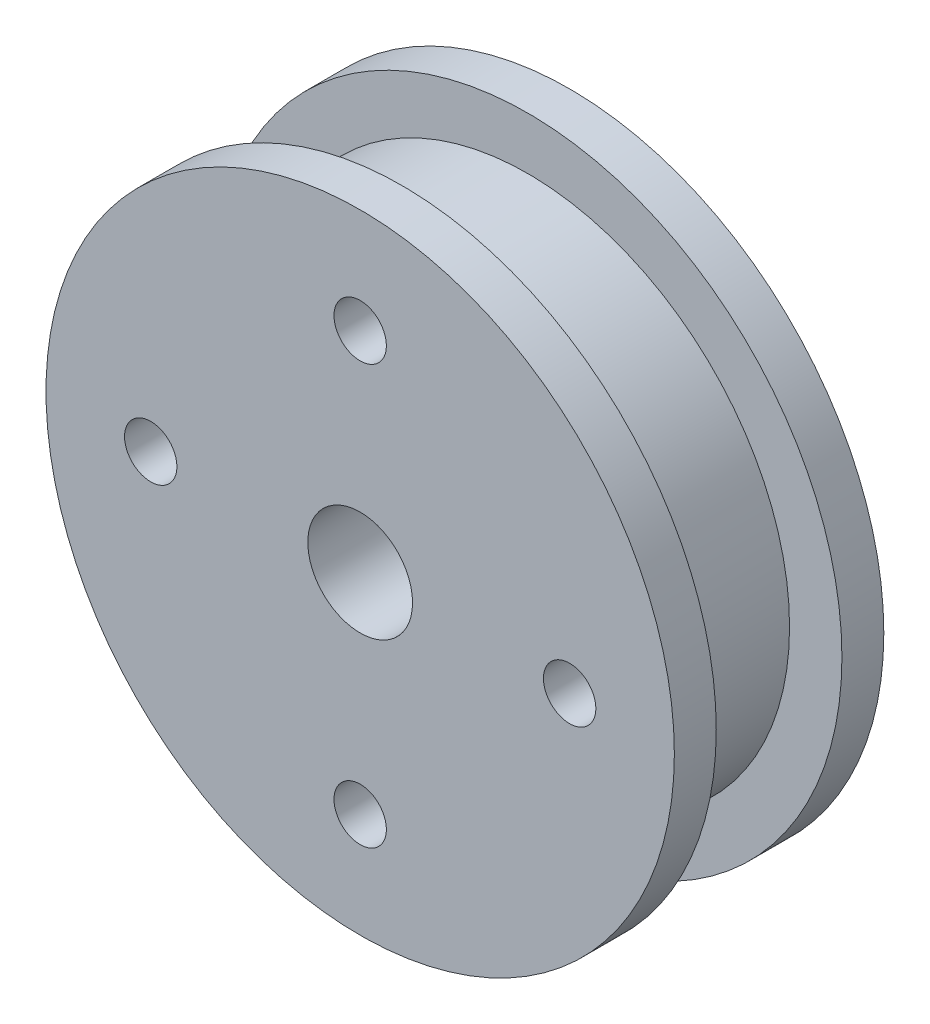
ISO-10303-21;
HEADER;
FILE_DESCRIPTION(('STEP AP214'),'2;1');
FILE_NAME('part.step','',(''),(''),'','','');
FILE_SCHEMA(('AUTOMOTIVE_DESIGN { 1 0 10303 214 1 1 1 1 }'));
ENDSEC;
DATA;
#1=APPLICATION_CONTEXT('core data for automotive mechanical design processes');
#2=APPLICATION_PROTOCOL_DEFINITION('international standard','automotive_design',2000,#1);
#3=PRODUCT_CONTEXT('',#1,'mechanical');
#4=PRODUCT('Part','Part','',(#3));
#5=PRODUCT_RELATED_PRODUCT_CATEGORY('part','',(#4));
#6=PRODUCT_DEFINITION_FORMATION('','',#4);
#7=PRODUCT_DEFINITION_CONTEXT('part definition',#1,'design');
#8=PRODUCT_DEFINITION('design','',#6,#7);
#9=PRODUCT_DEFINITION_SHAPE('','',#8);
#10=(LENGTH_UNIT() NAMED_UNIT(*) SI_UNIT(.MILLI.,.METRE.));
#11=(NAMED_UNIT(*) PLANE_ANGLE_UNIT() SI_UNIT($,.RADIAN.));
#12=(NAMED_UNIT(*) SI_UNIT($,.STERADIAN.) SOLID_ANGLE_UNIT());
#13=UNCERTAINTY_MEASURE_WITH_UNIT(LENGTH_MEASURE(1.E-05),#10,'distance_accuracy_value','');
#14=(GEOMETRIC_REPRESENTATION_CONTEXT(3) GLOBAL_UNCERTAINTY_ASSIGNED_CONTEXT((#13)) GLOBAL_UNIT_ASSIGNED_CONTEXT((#10,
#11,#12)) REPRESENTATION_CONTEXT('',''));
#15=CARTESIAN_POINT('',(0.,0.,0.));
#16=DIRECTION('',(0.,0.,1.));
#17=DIRECTION('',(1.,0.,0.));
#18=AXIS2_PLACEMENT_3D('',#15,#16,#17);
#19=CARTESIAN_POINT('',(0.,0.,2.54));
#20=DIRECTION('',(0.,0.,-1.));
#21=DIRECTION('',(-1.,0.,0.));
#22=AXIS2_PLACEMENT_3D('',#19,#20,#21);
#23=CYLINDRICAL_SURFACE('',#22,19.05);
#24=CARTESIAN_POINT('',(0.,0.,2.54));
#25=DIRECTION('',(0.,0.,1.));
#26=DIRECTION('',(1.,0.,0.));
#27=AXIS2_PLACEMENT_3D('',#24,#25,#26);
#28=CIRCLE('',#27,19.05);
#29=CARTESIAN_POINT('',(19.05,0.,2.54));
#30=VERTEX_POINT('',#29);
#31=EDGE_CURVE('E38',#30,#30,#28,.T.);
#32=ORIENTED_EDGE('',*,*,#31,.F.);
#33=EDGE_LOOP('',(#32));
#34=FACE_BOUND('',#33,.T.);
#35=CARTESIAN_POINT('',(0.,0.,0.));
#36=DIRECTION('',(0.,0.,1.));
#37=DIRECTION('',(1.,0.,0.));
#38=AXIS2_PLACEMENT_3D('',#35,#36,#37);
#39=CIRCLE('',#38,19.05);
#40=CARTESIAN_POINT('',(19.05,0.,0.));
#41=VERTEX_POINT('',#40);
#42=EDGE_CURVE('E34',#41,#41,#39,.T.);
#43=ORIENTED_EDGE('',*,*,#42,.T.);
#44=EDGE_LOOP('',(#43));
#45=FACE_BOUND('',#44,.T.);
#46=ADVANCED_FACE('F31',(#34,#45),#23,.T.);
#47=CARTESIAN_POINT('',(0.,0.,2.54));
#48=DIRECTION('',(0.,0.,1.));
#49=DIRECTION('',(1.,0.,0.));
#50=AXIS2_PLACEMENT_3D('',#47,#48,#49);
#51=PLANE('',#50);
#52=CARTESIAN_POINT('',(0.,0.,2.54));
#53=DIRECTION('',(0.,0.,1.));
#54=DIRECTION('',(1.,0.,0.));
#55=AXIS2_PLACEMENT_3D('',#52,#53,#54);
#56=CIRCLE('',#55,15.875);
#57=CARTESIAN_POINT('',(15.875,0.,2.54));
#58=VERTEX_POINT('',#57);
#59=EDGE_CURVE('E10',#58,#58,#56,.T.);
#60=ORIENTED_EDGE('',*,*,#59,.F.);
#61=EDGE_LOOP('',(#60));
#62=FACE_BOUND('',#61,.T.);
#63=ORIENTED_EDGE('',*,*,#31,.T.);
#64=EDGE_LOOP('',(#63));
#65=FACE_BOUND('',#64,.T.);
#66=ADVANCED_FACE('F91',(#62,#65),#51,.T.);
#67=CARTESIAN_POINT('',(0.,0.,0.));
#68=DIRECTION('',(0.,0.,1.));
#69=DIRECTION('',(1.,0.,0.));
#70=AXIS2_PLACEMENT_3D('',#67,#68,#69);
#71=PLANE('',#70);
#72=CARTESIAN_POINT('',(0.,12.7,0.));
#73=DIRECTION('',(0.,0.,-1.));
#74=DIRECTION('',(-1.,0.,0.));
#75=AXIS2_PLACEMENT_3D('',#72,#73,#74);
#76=CIRCLE('',#75,1.5875);
#77=CARTESIAN_POINT('',(-1.58749999999999,12.7,0.));
#78=VERTEX_POINT('',#77);
#79=EDGE_CURVE('E76',#78,#78,#76,.T.);
#80=ORIENTED_EDGE('',*,*,#79,.F.);
#81=EDGE_LOOP('',(#80));
#82=FACE_BOUND('',#81,.T.);
#83=CARTESIAN_POINT('',(-12.7,0.,0.));
#84=DIRECTION('',(0.,0.,-1.));
#85=DIRECTION('',(-1.,0.,0.));
#86=AXIS2_PLACEMENT_3D('',#83,#84,#85);
#87=CIRCLE('',#86,1.5875);
#88=CARTESIAN_POINT('',(-14.2875,0.,0.));
#89=VERTEX_POINT('',#88);
#90=EDGE_CURVE('E70',#89,#89,#87,.T.);
#91=ORIENTED_EDGE('',*,*,#90,.F.);
#92=EDGE_LOOP('',(#91));
#93=FACE_BOUND('',#92,.T.);
#94=CARTESIAN_POINT('',(0.,-12.7,0.));
#95=DIRECTION('',(0.,0.,-1.));
#96=DIRECTION('',(-1.,0.,0.));
#97=AXIS2_PLACEMENT_3D('',#94,#95,#96);
#98=CIRCLE('',#97,1.5875);
#99=CARTESIAN_POINT('',(-1.5875,-12.7,0.));
#100=VERTEX_POINT('',#99);
#101=EDGE_CURVE('E63',#100,#100,#98,.T.);
#102=ORIENTED_EDGE('',*,*,#101,.F.);
#103=EDGE_LOOP('',(#102));
#104=FACE_BOUND('',#103,.T.);
#105=CARTESIAN_POINT('',(12.7,0.,0.));
#106=DIRECTION('',(0.,0.,-1.));
#107=DIRECTION('',(-1.,0.,0.));
#108=AXIS2_PLACEMENT_3D('',#105,#106,#107);
#109=CIRCLE('',#108,1.5875);
#110=CARTESIAN_POINT('',(11.1125,0.,0.));
#111=VERTEX_POINT('',#110);
#112=EDGE_CURVE('E64',#111,#111,#109,.T.);
#113=ORIENTED_EDGE('',*,*,#112,.F.);
#114=EDGE_LOOP('',(#113));
#115=FACE_BOUND('',#114,.T.);
#116=CARTESIAN_POINT('',(0.,0.,0.));
#117=DIRECTION('',(0.,0.,1.));
#118=DIRECTION('',(1.,0.,0.));
#119=AXIS2_PLACEMENT_3D('',#116,#117,#118);
#120=CIRCLE('',#119,3.175);
#121=CARTESIAN_POINT('',(3.175,0.,0.));
#122=VERTEX_POINT('',#121);
#123=EDGE_CURVE('E51',#122,#122,#120,.F.);
#124=ORIENTED_EDGE('',*,*,#123,.F.);
#125=EDGE_LOOP('',(#124));
#126=FACE_BOUND('',#125,.T.);
#127=ORIENTED_EDGE('',*,*,#42,.F.);
#128=EDGE_LOOP('',(#127));
#129=FACE_BOUND('',#128,.T.);
#130=ADVANCED_FACE('F87',(#82,#93,#104,#115,#126,#129),#71,.F.);
#131=CARTESIAN_POINT('',(0.,0.,10.16));
#132=DIRECTION('',(0.,0.,-1.));
#133=DIRECTION('',(-1.,0.,0.));
#134=AXIS2_PLACEMENT_3D('',#131,#132,#133);
#135=CYLINDRICAL_SURFACE('',#134,15.875);
#136=CARTESIAN_POINT('',(0.,0.,10.16));
#137=DIRECTION('',(0.,0.,1.));
#138=DIRECTION('',(1.,0.,0.));
#139=AXIS2_PLACEMENT_3D('',#136,#137,#138);
#140=CIRCLE('',#139,15.875);
#141=CARTESIAN_POINT('',(15.875,0.,10.16));
#142=VERTEX_POINT('',#141);
#143=EDGE_CURVE('E44',#142,#142,#140,.T.);
#144=ORIENTED_EDGE('',*,*,#143,.F.);
#145=EDGE_LOOP('',(#144));
#146=FACE_BOUND('',#145,.T.);
#147=ORIENTED_EDGE('',*,*,#59,.T.);
#148=EDGE_LOOP('',(#147));
#149=FACE_BOUND('',#148,.T.);
#150=ADVANCED_FACE('F90',(#146,#149),#135,.T.);
#151=CARTESIAN_POINT('',(0.,0.,10.16));
#152=DIRECTION('',(0.,0.,1.));
#153=DIRECTION('',(1.,0.,0.));
#154=AXIS2_PLACEMENT_3D('',#151,#152,#153);
#155=CYLINDRICAL_SURFACE('',#154,19.05);
#156=CARTESIAN_POINT('',(0.,0.,10.16));
#157=DIRECTION('',(0.,0.,1.));
#158=DIRECTION('',(1.,0.,0.));
#159=AXIS2_PLACEMENT_3D('',#156,#157,#158);
#160=CIRCLE('',#159,19.05);
#161=CARTESIAN_POINT('',(19.05,0.,10.16));
#162=VERTEX_POINT('',#161);
#163=EDGE_CURVE('E47',#162,#162,#160,.T.);
#164=ORIENTED_EDGE('',*,*,#163,.T.);
#165=EDGE_LOOP('',(#164));
#166=FACE_BOUND('',#165,.T.);
#167=CARTESIAN_POINT('',(0.,0.,12.7));
#168=DIRECTION('',(0.,0.,1.));
#169=DIRECTION('',(1.,0.,0.));
#170=AXIS2_PLACEMENT_3D('',#167,#168,#169);
#171=CIRCLE('',#170,19.05);
#172=CARTESIAN_POINT('',(19.05,0.,12.7));
#173=VERTEX_POINT('',#172);
#174=EDGE_CURVE('E48',#173,#173,#171,.T.);
#175=ORIENTED_EDGE('',*,*,#174,.F.);
#176=EDGE_LOOP('',(#175));
#177=FACE_BOUND('',#176,.T.);
#178=ADVANCED_FACE('F117',(#166,#177),#155,.T.);
#179=CARTESIAN_POINT('',(0.,0.,10.16));
#180=DIRECTION('',(0.,0.,-1.));
#181=DIRECTION('',(1.,0.,0.));
#182=AXIS2_PLACEMENT_3D('',#179,#180,#181);
#183=PLANE('',#182);
#184=ORIENTED_EDGE('',*,*,#143,.T.);
#185=EDGE_LOOP('',(#184));
#186=FACE_BOUND('',#185,.T.);
#187=ORIENTED_EDGE('',*,*,#163,.F.);
#188=EDGE_LOOP('',(#187));
#189=FACE_BOUND('',#188,.T.);
#190=ADVANCED_FACE('F121',(#186,#189),#183,.T.);
#191=CARTESIAN_POINT('',(0.,0.,12.7));
#192=DIRECTION('',(0.,0.,-1.));
#193=DIRECTION('',(1.,0.,0.));
#194=AXIS2_PLACEMENT_3D('',#191,#192,#193);
#195=PLANE('',#194);
#196=CARTESIAN_POINT('',(0.,12.7,12.7));
#197=DIRECTION('',(0.,0.,-1.));
#198=DIRECTION('',(-1.,0.,0.));
#199=AXIS2_PLACEMENT_3D('',#196,#197,#198);
#200=CIRCLE('',#199,1.5875);
#201=CARTESIAN_POINT('',(-1.58749999999999,12.7,12.7));
#202=VERTEX_POINT('',#201);
#203=EDGE_CURVE('E59',#202,#202,#200,.F.);
#204=ORIENTED_EDGE('',*,*,#203,.F.);
#205=EDGE_LOOP('',(#204));
#206=FACE_BOUND('',#205,.T.);
#207=CARTESIAN_POINT('',(-12.7,0.,12.7));
#208=DIRECTION('',(0.,0.,-1.));
#209=DIRECTION('',(-1.,0.,0.));
#210=AXIS2_PLACEMENT_3D('',#207,#208,#209);
#211=CIRCLE('',#210,1.5875);
#212=CARTESIAN_POINT('',(-14.2875,0.,12.7));
#213=VERTEX_POINT('',#212);
#214=EDGE_CURVE('E73',#213,#213,#211,.F.);
#215=ORIENTED_EDGE('',*,*,#214,.F.);
#216=EDGE_LOOP('',(#215));
#217=FACE_BOUND('',#216,.T.);
#218=CARTESIAN_POINT('',(0.,-12.7,12.7));
#219=DIRECTION('',(0.,0.,-1.));
#220=DIRECTION('',(-1.,0.,0.));
#221=AXIS2_PLACEMENT_3D('',#218,#219,#220);
#222=CIRCLE('',#221,1.5875);
#223=CARTESIAN_POINT('',(-1.5875,-12.7,12.7));
#224=VERTEX_POINT('',#223);
#225=EDGE_CURVE('E67',#224,#224,#222,.F.);
#226=ORIENTED_EDGE('',*,*,#225,.F.);
#227=EDGE_LOOP('',(#226));
#228=FACE_BOUND('',#227,.T.);
#229=CARTESIAN_POINT('',(12.7,0.,12.7));
#230=DIRECTION('',(0.,0.,-1.));
#231=DIRECTION('',(-1.,0.,0.));
#232=AXIS2_PLACEMENT_3D('',#229,#230,#231);
#233=CIRCLE('',#232,1.5875);
#234=CARTESIAN_POINT('',(11.1125,0.,12.7));
#235=VERTEX_POINT('',#234);
#236=EDGE_CURVE('E60',#235,#235,#233,.F.);
#237=ORIENTED_EDGE('',*,*,#236,.F.);
#238=EDGE_LOOP('',(#237));
#239=FACE_BOUND('',#238,.T.);
#240=CARTESIAN_POINT('',(0.,0.,12.7));
#241=DIRECTION('',(0.,0.,1.));
#242=DIRECTION('',(1.,0.,0.));
#243=AXIS2_PLACEMENT_3D('',#240,#241,#242);
#244=CIRCLE('',#243,3.175);
#245=CARTESIAN_POINT('',(3.175,0.,12.7));
#246=VERTEX_POINT('',#245);
#247=EDGE_CURVE('E56',#246,#246,#244,.T.);
#248=ORIENTED_EDGE('',*,*,#247,.F.);
#249=EDGE_LOOP('',(#248));
#250=FACE_BOUND('',#249,.T.);
#251=ORIENTED_EDGE('',*,*,#174,.T.);
#252=EDGE_LOOP('',(#251));
#253=FACE_BOUND('',#252,.T.);
#254=ADVANCED_FACE('F123',(#206,#217,#228,#239,#250,#253),#195,.F.);
#255=CARTESIAN_POINT('',(0.,0.,-0.000999999999999265));
#256=DIRECTION('',(0.,0.,1.));
#257=DIRECTION('',(1.,0.,0.));
#258=AXIS2_PLACEMENT_3D('',#255,#256,#257);
#259=CYLINDRICAL_SURFACE('',#258,3.175);
#260=ORIENTED_EDGE('',*,*,#247,.T.);
#261=EDGE_LOOP('',(#260));
#262=FACE_BOUND('',#261,.T.);
#263=ORIENTED_EDGE('',*,*,#123,.T.);
#264=EDGE_LOOP('',(#263));
#265=FACE_BOUND('',#264,.T.);
#266=ADVANCED_FACE('F126',(#262,#265),#259,.F.);
#267=CARTESIAN_POINT('',(12.7,0.,12.701));
#268=DIRECTION('',(0.,0.,-1.));
#269=DIRECTION('',(-1.,0.,0.));
#270=AXIS2_PLACEMENT_3D('',#267,#268,#269);
#271=CYLINDRICAL_SURFACE('',#270,1.5875);
#272=ORIENTED_EDGE('',*,*,#112,.T.);
#273=EDGE_LOOP('',(#272));
#274=FACE_BOUND('',#273,.T.);
#275=ORIENTED_EDGE('',*,*,#236,.T.);
#276=EDGE_LOOP('',(#275));
#277=FACE_BOUND('',#276,.T.);
#278=ADVANCED_FACE('F133',(#274,#277),#271,.F.);
#279=CARTESIAN_POINT('',(0.,-12.7,12.701));
#280=DIRECTION('',(0.,0.,-1.));
#281=DIRECTION('',(-1.,0.,0.));
#282=AXIS2_PLACEMENT_3D('',#279,#280,#281);
#283=CYLINDRICAL_SURFACE('',#282,1.5875);
#284=ORIENTED_EDGE('',*,*,#101,.T.);
#285=EDGE_LOOP('',(#284));
#286=FACE_BOUND('',#285,.T.);
#287=ORIENTED_EDGE('',*,*,#225,.T.);
#288=EDGE_LOOP('',(#287));
#289=FACE_BOUND('',#288,.T.);
#290=ADVANCED_FACE('F137',(#286,#289),#283,.F.);
#291=CARTESIAN_POINT('',(-12.7,0.,12.701));
#292=DIRECTION('',(0.,0.,-1.));
#293=DIRECTION('',(-1.,0.,0.));
#294=AXIS2_PLACEMENT_3D('',#291,#292,#293);
#295=CYLINDRICAL_SURFACE('',#294,1.5875);
#296=ORIENTED_EDGE('',*,*,#90,.T.);
#297=EDGE_LOOP('',(#296));
#298=FACE_BOUND('',#297,.T.);
#299=ORIENTED_EDGE('',*,*,#214,.T.);
#300=EDGE_LOOP('',(#299));
#301=FACE_BOUND('',#300,.T.);
#302=ADVANCED_FACE('F141',(#298,#301),#295,.F.);
#303=CARTESIAN_POINT('',(0.,12.7,12.701));
#304=DIRECTION('',(0.,0.,-1.));
#305=DIRECTION('',(-1.,0.,0.));
#306=AXIS2_PLACEMENT_3D('',#303,#304,#305);
#307=CYLINDRICAL_SURFACE('',#306,1.5875);
#308=ORIENTED_EDGE('',*,*,#79,.T.);
#309=EDGE_LOOP('',(#308));
#310=FACE_BOUND('',#309,.T.);
#311=ORIENTED_EDGE('',*,*,#203,.T.);
#312=EDGE_LOOP('',(#311));
#313=FACE_BOUND('',#312,.T.);
#314=ADVANCED_FACE('F84',(#310,#313),#307,.F.);
#315=CLOSED_SHELL('',(#46,#66,#130,#150,#178,#190,#254,#266,#278,#290,#302,#314));
#316=MANIFOLD_SOLID_BREP('B2',#315);
#317=ADVANCED_BREP_SHAPE_REPRESENTATION('',(#18,#316),#14);
#318=SHAPE_DEFINITION_REPRESENTATION(#9,#317);
ENDSEC;
END-ISO-10303-21;
